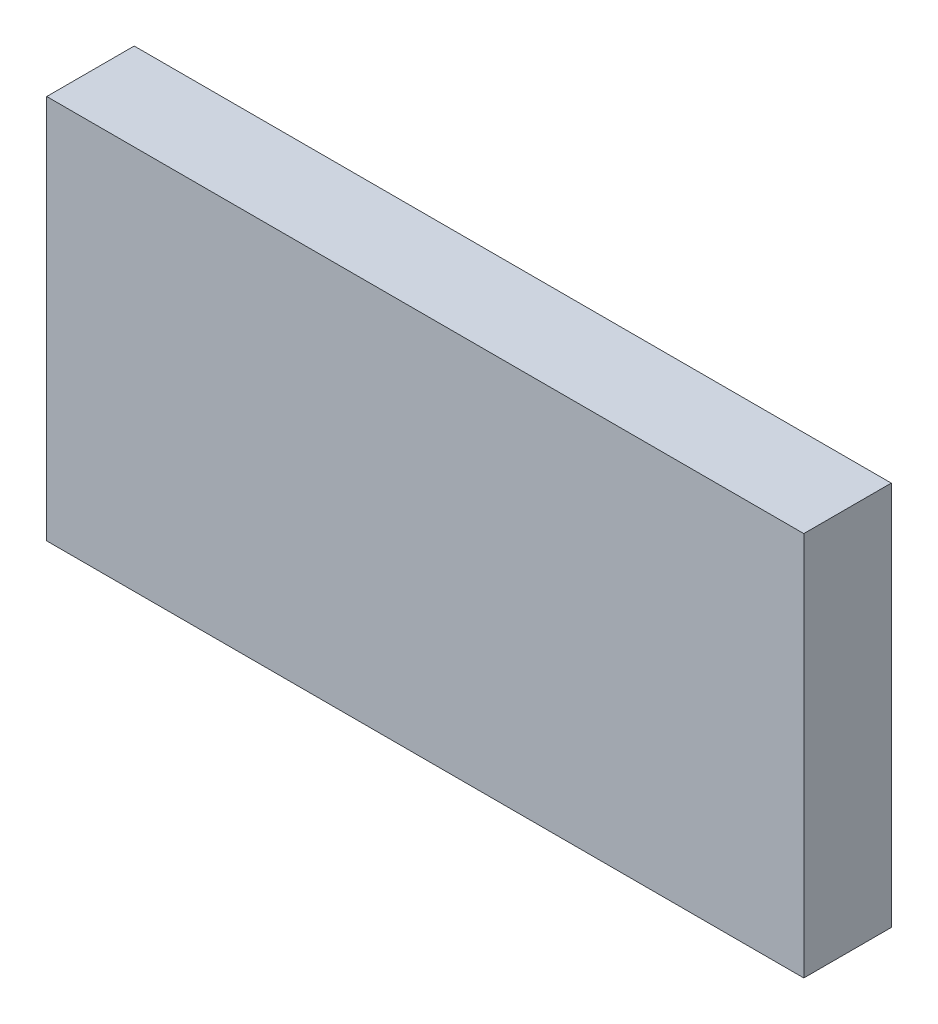
ISO-10303-21;
HEADER;
FILE_DESCRIPTION(('STEP AP214'),'2;1');
FILE_NAME('part.step','',(''),(''),'','','');
FILE_SCHEMA(('AUTOMOTIVE_DESIGN { 1 0 10303 214 1 1 1 1 }'));
ENDSEC;
DATA;
#1=APPLICATION_CONTEXT('core data for automotive mechanical design processes');
#2=APPLICATION_PROTOCOL_DEFINITION('international standard','automotive_design',2000,#1);
#3=PRODUCT_CONTEXT('',#1,'mechanical');
#4=PRODUCT('Part','Part','',(#3));
#5=PRODUCT_RELATED_PRODUCT_CATEGORY('part','',(#4));
#6=PRODUCT_DEFINITION_FORMATION('','',#4);
#7=PRODUCT_DEFINITION_CONTEXT('part definition',#1,'design');
#8=PRODUCT_DEFINITION('design','',#6,#7);
#9=PRODUCT_DEFINITION_SHAPE('','',#8);
#10=(LENGTH_UNIT() NAMED_UNIT(*) SI_UNIT(.MILLI.,.METRE.));
#11=(NAMED_UNIT(*) PLANE_ANGLE_UNIT() SI_UNIT($,.RADIAN.));
#12=(NAMED_UNIT(*) SI_UNIT($,.STERADIAN.) SOLID_ANGLE_UNIT());
#13=UNCERTAINTY_MEASURE_WITH_UNIT(LENGTH_MEASURE(1.E-05),#10,'distance_accuracy_value','');
#14=(GEOMETRIC_REPRESENTATION_CONTEXT(3) GLOBAL_UNCERTAINTY_ASSIGNED_CONTEXT((#13)) GLOBAL_UNIT_ASSIGNED_CONTEXT((#10,
#11,#12)) REPRESENTATION_CONTEXT('',''));
#15=CARTESIAN_POINT('',(0.,0.,0.));
#16=DIRECTION('',(0.,0.,1.));
#17=DIRECTION('',(1.,0.,0.));
#18=AXIS2_PLACEMENT_3D('',#15,#16,#17);
#19=CARTESIAN_POINT('',(-1.445,0.98,0.));
#20=DIRECTION('',(1.,0.,0.));
#21=DIRECTION('',(0.,0.,1.));
#22=AXIS2_PLACEMENT_3D('',#19,#20,#21);
#23=PLANE('',#22);
#24=DIRECTION('',(0.,1.,0.));
#25=VECTOR('',#24,1.);
#26=CARTESIAN_POINT('',(-1.445,0.98,0.1));
#27=LINE('',#26,#25);
#28=CARTESIAN_POINT('',(-1.445,0.98,0.1));
#29=VERTEX_POINT('',#28);
#30=CARTESIAN_POINT('',(-1.445,1.42,0.1));
#31=VERTEX_POINT('',#30);
#32=EDGE_CURVE('E11',#29,#31,#27,.T.);
#33=ORIENTED_EDGE('',*,*,#32,.T.);
#34=DIRECTION('',(0.,0.,1.));
#35=VECTOR('',#34,1.);
#36=CARTESIAN_POINT('',(-1.445,1.42,0.));
#37=LINE('',#36,#35);
#38=CARTESIAN_POINT('',(-1.445,1.42,0.));
#39=VERTEX_POINT('',#38);
#40=EDGE_CURVE('E24',#39,#31,#37,.T.);
#41=ORIENTED_EDGE('',*,*,#40,.F.);
#42=DIRECTION('',(0.,1.,0.));
#43=VECTOR('',#42,1.);
#44=CARTESIAN_POINT('',(-1.445,0.98,0.));
#45=LINE('',#44,#43);
#46=CARTESIAN_POINT('',(-1.445,0.98,0.));
#47=VERTEX_POINT('',#46);
#48=EDGE_CURVE('E86',#47,#39,#45,.T.);
#49=ORIENTED_EDGE('',*,*,#48,.F.);
#50=DIRECTION('',(0.,0.,1.));
#51=VECTOR('',#50,1.);
#52=CARTESIAN_POINT('',(-1.445,0.98,0.));
#53=LINE('',#52,#51);
#54=EDGE_CURVE('E36',#47,#29,#53,.T.);
#55=ORIENTED_EDGE('',*,*,#54,.T.);
#56=EDGE_LOOP('',(#33,#41,#49,#55));
#57=FACE_BOUND('',#56,.T.);
#58=ADVANCED_FACE('F17',(#57),#23,.F.);
#59=CARTESIAN_POINT('',(-0.5795,0.98,0.));
#60=DIRECTION('',(1.,0.,0.));
#61=DIRECTION('',(0.,0.,1.));
#62=AXIS2_PLACEMENT_3D('',#59,#60,#61);
#63=PLANE('',#62);
#64=DIRECTION('',(0.,0.,1.));
#65=VECTOR('',#64,1.);
#66=CARTESIAN_POINT('',(-0.5795,0.98,0.));
#67=LINE('',#66,#65);
#68=CARTESIAN_POINT('',(-0.5795,0.98,0.));
#69=VERTEX_POINT('',#68);
#70=CARTESIAN_POINT('',(-0.5795,0.98,0.1));
#71=VERTEX_POINT('',#70);
#72=EDGE_CURVE('E83',#69,#71,#67,.T.);
#73=ORIENTED_EDGE('',*,*,#72,.F.);
#74=DIRECTION('',(0.,1.,0.));
#75=VECTOR('',#74,1.);
#76=CARTESIAN_POINT('',(-0.5795,0.98,0.));
#77=LINE('',#76,#75);
#78=CARTESIAN_POINT('',(-0.5795,1.42,0.));
#79=VERTEX_POINT('',#78);
#80=EDGE_CURVE('E63',#69,#79,#77,.T.);
#81=ORIENTED_EDGE('',*,*,#80,.T.);
#82=DIRECTION('',(0.,0.,1.));
#83=VECTOR('',#82,1.);
#84=CARTESIAN_POINT('',(-0.5795,1.42,0.));
#85=LINE('',#84,#83);
#86=CARTESIAN_POINT('',(-0.5795,1.42,0.1));
#87=VERTEX_POINT('',#86);
#88=EDGE_CURVE('E57',#79,#87,#85,.T.);
#89=ORIENTED_EDGE('',*,*,#88,.T.);
#90=DIRECTION('',(0.,1.,0.));
#91=VECTOR('',#90,1.);
#92=CARTESIAN_POINT('',(-0.5795,0.98,0.1));
#93=LINE('',#92,#91);
#94=EDGE_CURVE('E60',#71,#87,#93,.T.);
#95=ORIENTED_EDGE('',*,*,#94,.F.);
#96=EDGE_LOOP('',(#73,#81,#89,#95));
#97=FACE_BOUND('',#96,.T.);
#98=ADVANCED_FACE('F59',(#97),#63,.T.);
#99=CARTESIAN_POINT('',(-1.445,0.98,0.));
#100=DIRECTION('',(0.,1.,0.));
#101=DIRECTION('',(0.,0.,1.));
#102=AXIS2_PLACEMENT_3D('',#99,#100,#101);
#103=PLANE('',#102);
#104=ORIENTED_EDGE('',*,*,#72,.T.);
#105=DIRECTION('',(1.,0.,0.));
#106=VECTOR('',#105,1.);
#107=CARTESIAN_POINT('',(-1.445,0.98,0.1));
#108=LINE('',#107,#106);
#109=EDGE_CURVE('E71',#29,#71,#108,.T.);
#110=ORIENTED_EDGE('',*,*,#109,.F.);
#111=ORIENTED_EDGE('',*,*,#54,.F.);
#112=DIRECTION('',(1.,0.,0.));
#113=VECTOR('',#112,1.);
#114=CARTESIAN_POINT('',(-1.445,0.98,0.));
#115=LINE('',#114,#113);
#116=EDGE_CURVE('E76',#47,#69,#115,.T.);
#117=ORIENTED_EDGE('',*,*,#116,.T.);
#118=EDGE_LOOP('',(#104,#110,#111,#117));
#119=FACE_BOUND('',#118,.T.);
#120=ADVANCED_FACE('F91',(#119),#103,.F.);
#121=CARTESIAN_POINT('',(-1.445,1.42,0.));
#122=DIRECTION('',(0.,1.,0.));
#123=DIRECTION('',(0.,0.,1.));
#124=AXIS2_PLACEMENT_3D('',#121,#122,#123);
#125=PLANE('',#124);
#126=DIRECTION('',(1.,0.,0.));
#127=VECTOR('',#126,1.);
#128=CARTESIAN_POINT('',(-1.445,1.42,0.));
#129=LINE('',#128,#127);
#130=EDGE_CURVE('E74',#39,#79,#129,.T.);
#131=ORIENTED_EDGE('',*,*,#130,.F.);
#132=ORIENTED_EDGE('',*,*,#40,.T.);
#133=DIRECTION('',(1.,0.,0.));
#134=VECTOR('',#133,1.);
#135=CARTESIAN_POINT('',(-1.445,1.42,0.1));
#136=LINE('',#135,#134);
#137=EDGE_CURVE('E69',#31,#87,#136,.T.);
#138=ORIENTED_EDGE('',*,*,#137,.T.);
#139=ORIENTED_EDGE('',*,*,#88,.F.);
#140=EDGE_LOOP('',(#131,#132,#138,#139));
#141=FACE_BOUND('',#140,.T.);
#142=ADVANCED_FACE('F73',(#141),#125,.T.);
#143=CARTESIAN_POINT('',(-1.445,0.98,0.));
#144=DIRECTION('',(0.,0.,1.));
#145=DIRECTION('',(1.,0.,0.));
#146=AXIS2_PLACEMENT_3D('',#143,#144,#145);
#147=PLANE('',#146);
#148=ORIENTED_EDGE('',*,*,#130,.T.);
#149=ORIENTED_EDGE('',*,*,#80,.F.);
#150=ORIENTED_EDGE('',*,*,#116,.F.);
#151=ORIENTED_EDGE('',*,*,#48,.T.);
#152=EDGE_LOOP('',(#148,#149,#150,#151));
#153=FACE_BOUND('',#152,.T.);
#154=ADVANCED_FACE('F89',(#153),#147,.F.);
#155=CARTESIAN_POINT('',(-1.445,0.98,0.1));
#156=DIRECTION('',(0.,0.,1.));
#157=DIRECTION('',(1.,0.,0.));
#158=AXIS2_PLACEMENT_3D('',#155,#156,#157);
#159=PLANE('',#158);
#160=ORIENTED_EDGE('',*,*,#32,.F.);
#161=ORIENTED_EDGE('',*,*,#109,.T.);
#162=ORIENTED_EDGE('',*,*,#94,.T.);
#163=ORIENTED_EDGE('',*,*,#137,.F.);
#164=EDGE_LOOP('',(#160,#161,#162,#163));
#165=FACE_BOUND('',#164,.T.);
#166=ADVANCED_FACE('F68',(#165),#159,.T.);
#167=CLOSED_SHELL('',(#58,#98,#120,#142,#154,#166));
#168=MANIFOLD_SOLID_BREP('B1',#167);
#169=ADVANCED_BREP_SHAPE_REPRESENTATION('',(#18,#168),#14);
#170=SHAPE_DEFINITION_REPRESENTATION(#9,#169);
ENDSEC;
END-ISO-10303-21;
